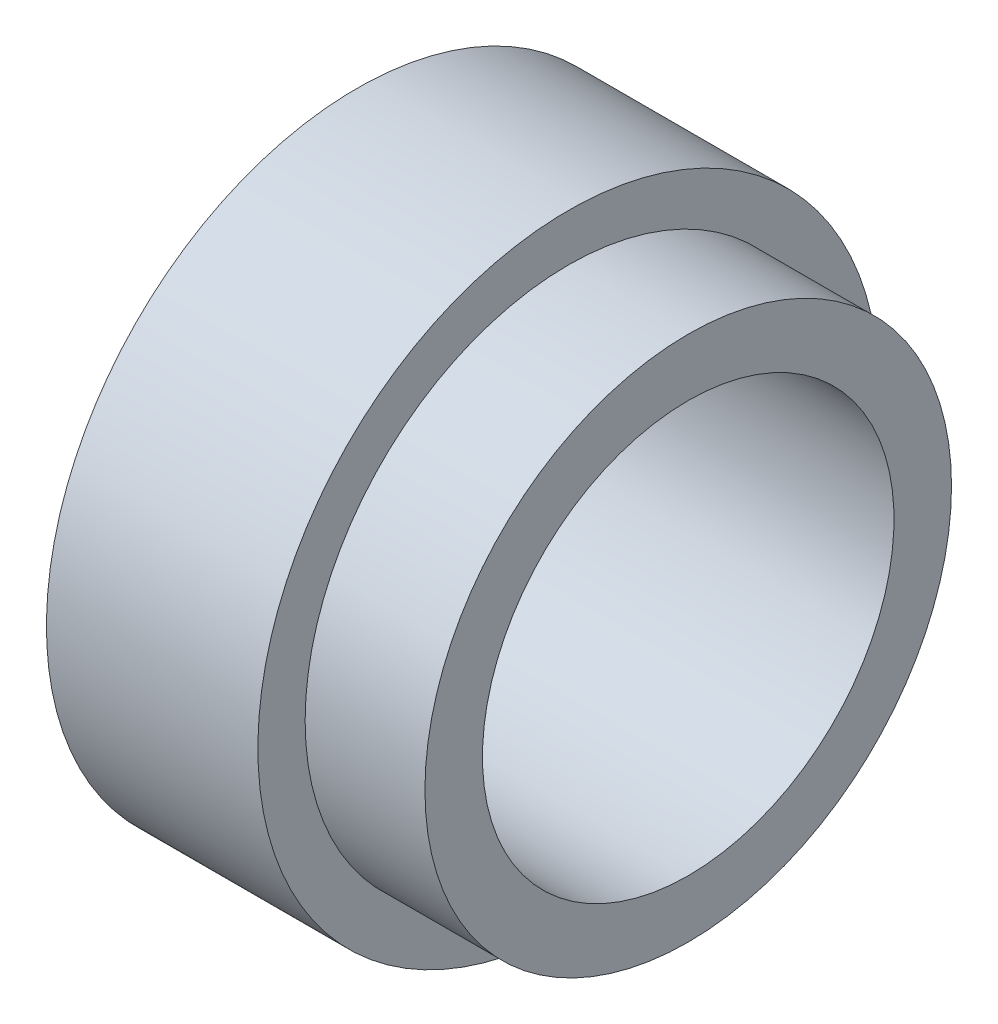
ISO-10303-21;
HEADER;
FILE_DESCRIPTION(('STEP AP214'),'2;1');
FILE_NAME('part.step','',(''),(''),'','','');
FILE_SCHEMA(('AUTOMOTIVE_DESIGN { 1 0 10303 214 1 1 1 1 }'));
ENDSEC;
DATA;
#1=APPLICATION_CONTEXT('core data for automotive mechanical design processes');
#2=APPLICATION_PROTOCOL_DEFINITION('international standard','automotive_design',2000,#1);
#3=PRODUCT_CONTEXT('',#1,'mechanical');
#4=PRODUCT('Part','Part','',(#3));
#5=PRODUCT_RELATED_PRODUCT_CATEGORY('part','',(#4));
#6=PRODUCT_DEFINITION_FORMATION('','',#4);
#7=PRODUCT_DEFINITION_CONTEXT('part definition',#1,'design');
#8=PRODUCT_DEFINITION('design','',#6,#7);
#9=PRODUCT_DEFINITION_SHAPE('','',#8);
#10=(LENGTH_UNIT() NAMED_UNIT(*) SI_UNIT(.MILLI.,.METRE.));
#11=(NAMED_UNIT(*) PLANE_ANGLE_UNIT() SI_UNIT($,.RADIAN.));
#12=(NAMED_UNIT(*) SI_UNIT($,.STERADIAN.) SOLID_ANGLE_UNIT());
#13=UNCERTAINTY_MEASURE_WITH_UNIT(LENGTH_MEASURE(1.E-05),#10,'distance_accuracy_value','');
#14=(GEOMETRIC_REPRESENTATION_CONTEXT(3) GLOBAL_UNCERTAINTY_ASSIGNED_CONTEXT((#13)) GLOBAL_UNIT_ASSIGNED_CONTEXT((#10,
#11,#12)) REPRESENTATION_CONTEXT('',''));
#15=CARTESIAN_POINT('',(0.,0.,0.));
#16=DIRECTION('',(0.,0.,1.));
#17=DIRECTION('',(1.,0.,0.));
#18=AXIS2_PLACEMENT_3D('',#15,#16,#17);
#19=CARTESIAN_POINT('',(-193.5541779404,-256.4639919478,-101.3080124712));
#20=DIRECTION('',(1.,0.,0.));
#21=DIRECTION('',(0.,0.,-1.));
#22=AXIS2_PLACEMENT_3D('',#19,#20,#21);
#23=PLANE('',#22);
#24=CARTESIAN_POINT('',(-193.5541779404,-217.671164606,-140.1008397876));
#25=DIRECTION('',(-1.,0.,0.));
#26=DIRECTION('',(0.,-1.,0.));
#27=AXIS2_PLACEMENT_3D('',#24,#25,#26);
#28=CIRCLE('',#27,32.4993);
#29=CARTESIAN_POINT('',(-193.5541779404,-250.170464606,-140.1008397876));
#30=VERTEX_POINT('',#29);
#31=EDGE_CURVE('E19',#30,#30,#28,.T.);
#32=ORIENTED_EDGE('',*,*,#31,.T.);
#33=EDGE_LOOP('',(#32));
#34=FACE_BOUND('',#33,.T.);
#35=CARTESIAN_POINT('',(-193.5541779404,-217.671164606,-140.1008397876));
#36=DIRECTION('',(-1.,0.,0.));
#37=DIRECTION('',(0.,-1.,0.));
#38=AXIS2_PLACEMENT_3D('',#35,#36,#37);
#39=CIRCLE('',#38,38.3328333164);
#40=CARTESIAN_POINT('',(-193.5541779404,-256.0039979224,-140.1008397876));
#41=VERTEX_POINT('',#40);
#42=EDGE_CURVE('E35',#41,#41,#39,.F.);
#43=ORIENTED_EDGE('',*,*,#42,.T.);
#44=EDGE_LOOP('',(#43));
#45=FACE_BOUND('',#44,.T.);
#46=ADVANCED_FACE('F15',(#34,#45),#23,.T.);
#47=CARTESIAN_POINT('',(-178.7662979404,-217.671164606,-140.1008397876));
#48=DIRECTION('',(-1.,0.,0.));
#49=DIRECTION('',(0.,-1.,0.));
#50=AXIS2_PLACEMENT_3D('',#47,#48,#49);
#51=CYLINDRICAL_SURFACE('',#50,32.4993);
#52=ORIENTED_EDGE('',*,*,#31,.F.);
#53=EDGE_LOOP('',(#52));
#54=FACE_BOUND('',#53,.T.);
#55=CARTESIAN_POINT('',(-178.7662979404,-217.671164606,-140.1008397876));
#56=DIRECTION('',(-1.,0.,0.));
#57=DIRECTION('',(0.,-1.,0.));
#58=AXIS2_PLACEMENT_3D('',#55,#56,#57);
#59=CIRCLE('',#58,32.4993);
#60=CARTESIAN_POINT('',(-178.7662979404,-250.170464606,-140.1008397876));
#61=VERTEX_POINT('',#60);
#62=EDGE_CURVE('E33',#61,#61,#59,.F.);
#63=ORIENTED_EDGE('',*,*,#62,.F.);
#64=EDGE_LOOP('',(#63));
#65=FACE_BOUND('',#64,.T.);
#66=ADVANCED_FACE('F43',(#54,#65),#51,.T.);
#67=CARTESIAN_POINT('',(-193.5541779404,-217.671164606,-140.1008397876));
#68=DIRECTION('',(-1.,0.,0.));
#69=DIRECTION('',(0.,-1.,0.));
#70=AXIS2_PLACEMENT_3D('',#67,#68,#69);
#71=CYLINDRICAL_SURFACE('',#70,38.3328333164);
#72=CARTESIAN_POINT('',(-219.6526779404,-217.671164606,-140.1008397876));
#73=DIRECTION('',(-1.,0.,0.));
#74=DIRECTION('',(0.,-1.,0.));
#75=AXIS2_PLACEMENT_3D('',#72,#73,#74);
#76=CIRCLE('',#75,38.3328333164);
#77=CARTESIAN_POINT('',(-219.6526779404,-256.0039979224,-140.1008397876));
#78=VERTEX_POINT('',#77);
#79=EDGE_CURVE('E28',#78,#78,#76,.T.);
#80=ORIENTED_EDGE('',*,*,#79,.F.);
#81=EDGE_LOOP('',(#80));
#82=FACE_BOUND('',#81,.T.);
#83=ORIENTED_EDGE('',*,*,#42,.F.);
#84=EDGE_LOOP('',(#83));
#85=FACE_BOUND('',#84,.T.);
#86=ADVANCED_FACE('F46',(#82,#85),#71,.T.);
#87=CARTESIAN_POINT('',(-178.7662979404,-250.560456206,-107.2115481876));
#88=DIRECTION('',(1.,0.,0.));
#89=DIRECTION('',(0.,0.,-1.));
#90=AXIS2_PLACEMENT_3D('',#87,#88,#89);
#91=PLANE('',#90);
#92=CARTESIAN_POINT('',(-178.7662979404,-217.671164606,-140.1008397876));
#93=DIRECTION('',(-1.,0.,0.));
#94=DIRECTION('',(0.,-1.,0.));
#95=AXIS2_PLACEMENT_3D('',#92,#93,#94);
#96=CIRCLE('',#95,25.4);
#97=CARTESIAN_POINT('',(-178.7662979404,-243.071164606,-140.1008397876));
#98=VERTEX_POINT('',#97);
#99=EDGE_CURVE('E23',#98,#98,#96,.F.);
#100=ORIENTED_EDGE('',*,*,#99,.F.);
#101=EDGE_LOOP('',(#100));
#102=FACE_BOUND('',#101,.T.);
#103=ORIENTED_EDGE('',*,*,#62,.T.);
#104=EDGE_LOOP('',(#103));
#105=FACE_BOUND('',#104,.T.);
#106=ADVANCED_FACE('F50',(#102,#105),#91,.T.);
#107=CARTESIAN_POINT('',(-219.6526779404,-256.4639919478,-178.8936671294));
#108=DIRECTION('',(-1.,0.,0.));
#109=DIRECTION('',(0.,0.,1.));
#110=AXIS2_PLACEMENT_3D('',#107,#108,#109);
#111=PLANE('',#110);
#112=CARTESIAN_POINT('',(-219.6526779404,-217.671164606,-140.1008397876));
#113=DIRECTION('',(-1.,0.,0.));
#114=DIRECTION('',(0.,-1.,0.));
#115=AXIS2_PLACEMENT_3D('',#112,#113,#114);
#116=CIRCLE('',#115,25.4);
#117=CARTESIAN_POINT('',(-219.6526779404,-243.071164606,-140.1008397876));
#118=VERTEX_POINT('',#117);
#119=EDGE_CURVE('E10',#118,#118,#116,.T.);
#120=ORIENTED_EDGE('',*,*,#119,.F.);
#121=EDGE_LOOP('',(#120));
#122=FACE_BOUND('',#121,.T.);
#123=ORIENTED_EDGE('',*,*,#79,.T.);
#124=EDGE_LOOP('',(#123));
#125=FACE_BOUND('',#124,.T.);
#126=ADVANCED_FACE('F17',(#122,#125),#111,.T.);
#127=CARTESIAN_POINT('',(-178.7662979404,-217.671164606,-140.1008397876));
#128=DIRECTION('',(-1.,0.,0.));
#129=DIRECTION('',(0.,-1.,0.));
#130=AXIS2_PLACEMENT_3D('',#127,#128,#129);
#131=CYLINDRICAL_SURFACE('',#130,25.4);
#132=ORIENTED_EDGE('',*,*,#119,.T.);
#133=EDGE_LOOP('',(#132));
#134=FACE_BOUND('',#133,.T.);
#135=ORIENTED_EDGE('',*,*,#99,.T.);
#136=EDGE_LOOP('',(#135));
#137=FACE_BOUND('',#136,.T.);
#138=ADVANCED_FACE('F58',(#134,#137),#131,.F.);
#139=CLOSED_SHELL('',(#46,#66,#86,#106,#126,#138));
#140=MANIFOLD_SOLID_BREP('B1',#139);
#141=ADVANCED_BREP_SHAPE_REPRESENTATION('',(#18,#140),#14);
#142=SHAPE_DEFINITION_REPRESENTATION(#9,#141);
ENDSEC;
END-ISO-10303-21;
